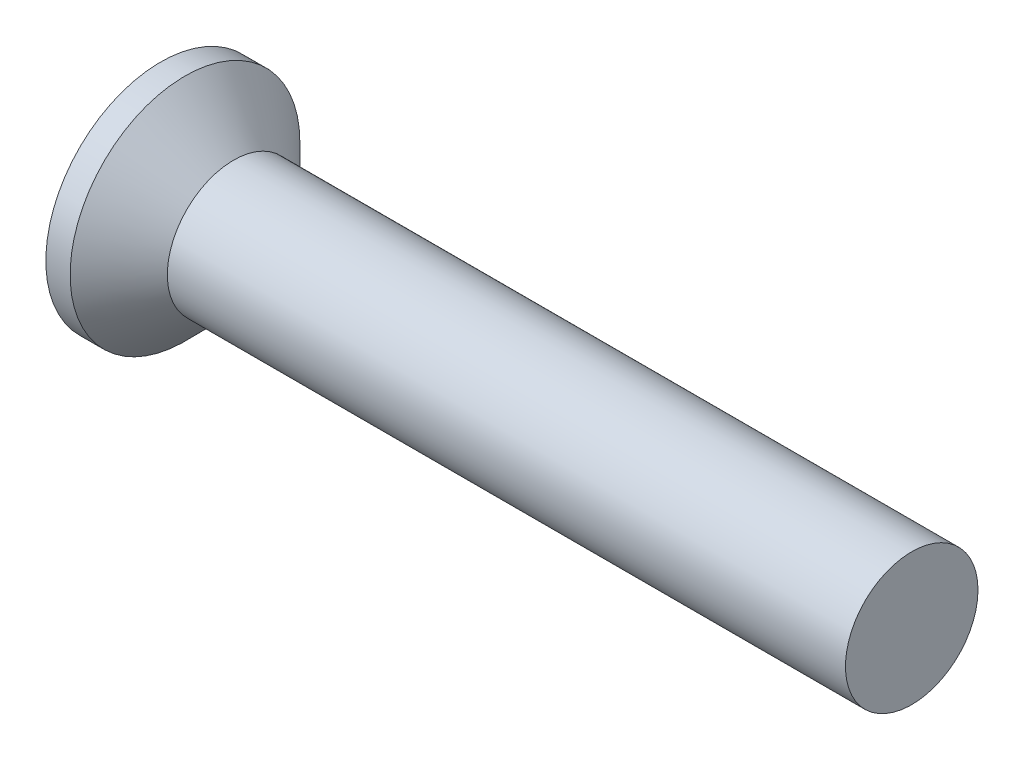
ISO-10303-21;
HEADER;
FILE_DESCRIPTION(('STEP AP214'),'2;1');
FILE_NAME('part.step','',(''),(''),'','','');
FILE_SCHEMA(('AUTOMOTIVE_DESIGN { 1 0 10303 214 1 1 1 1 }'));
ENDSEC;
DATA;
#1=APPLICATION_CONTEXT('core data for automotive mechanical design processes');
#2=APPLICATION_PROTOCOL_DEFINITION('international standard','automotive_design',2000,#1);
#3=PRODUCT_CONTEXT('',#1,'mechanical');
#4=PRODUCT('Part','Part','',(#3));
#5=PRODUCT_RELATED_PRODUCT_CATEGORY('part','',(#4));
#6=PRODUCT_DEFINITION_FORMATION('','',#4);
#7=PRODUCT_DEFINITION_CONTEXT('part definition',#1,'design');
#8=PRODUCT_DEFINITION('design','',#6,#7);
#9=PRODUCT_DEFINITION_SHAPE('','',#8);
#10=(LENGTH_UNIT() NAMED_UNIT(*) SI_UNIT(.MILLI.,.METRE.));
#11=(NAMED_UNIT(*) PLANE_ANGLE_UNIT() SI_UNIT($,.RADIAN.));
#12=(NAMED_UNIT(*) SI_UNIT($,.STERADIAN.) SOLID_ANGLE_UNIT());
#13=UNCERTAINTY_MEASURE_WITH_UNIT(LENGTH_MEASURE(1.E-05),#10,'distance_accuracy_value','');
#14=(GEOMETRIC_REPRESENTATION_CONTEXT(3) GLOBAL_UNCERTAINTY_ASSIGNED_CONTEXT((#13)) GLOBAL_UNIT_ASSIGNED_CONTEXT((#10,
#11,#12)) REPRESENTATION_CONTEXT('',''));
#15=CARTESIAN_POINT('',(0.,0.,0.));
#16=DIRECTION('',(0.,0.,1.));
#17=DIRECTION('',(1.,0.,0.));
#18=AXIS2_PLACEMENT_3D('',#15,#16,#17);
#19=CARTESIAN_POINT('',(0.,2.6,0.));
#20=DIRECTION('',(-1.,0.,0.));
#21=DIRECTION('',(0.,0.,1.));
#22=AXIS2_PLACEMENT_3D('',#19,#20,#21);
#23=PLANE('',#22);
#24=CARTESIAN_POINT('',(0.,0.,0.));
#25=DIRECTION('',(1.,0.,0.));
#26=DIRECTION('',(0.,0.,-1.));
#27=AXIS2_PLACEMENT_3D('',#24,#25,#26);
#28=CIRCLE('',#27,2.6);
#29=CARTESIAN_POINT('',(0.,0.,-2.6));
#30=VERTEX_POINT('',#29);
#31=EDGE_CURVE('E190',#30,#30,#28,.T.);
#32=ORIENTED_EDGE('',*,*,#31,.F.);
#33=EDGE_LOOP('',(#32));
#34=FACE_BOUND('',#33,.T.);
#35=DIRECTION('',(0.,1.,0.));
#36=VECTOR('',#35,1.);
#37=CARTESIAN_POINT('',(0.,-0.32,-0.32));
#38=LINE('',#37,#36);
#39=CARTESIAN_POINT('',(0.,-1.6,-0.32));
#40=VERTEX_POINT('',#39);
#41=CARTESIAN_POINT('',(0.,-0.62,-0.32));
#42=VERTEX_POINT('',#41);
#43=EDGE_CURVE('E316',#40,#42,#38,.T.);
#44=ORIENTED_EDGE('',*,*,#43,.T.);
#45=CARTESIAN_POINT('',(0.,-0.62,-0.62));
#46=DIRECTION('',(-1.,0.,0.));
#47=DIRECTION('',(0.,0.,1.));
#48=AXIS2_PLACEMENT_3D('',#45,#46,#47);
#49=CIRCLE('',#48,0.3);
#50=CARTESIAN_POINT('',(0.,-0.32,-0.62));
#51=VERTEX_POINT('',#50);
#52=EDGE_CURVE('E195',#42,#51,#49,.T.);
#53=ORIENTED_EDGE('',*,*,#52,.T.);
#54=DIRECTION('',(0.,0.,-1.));
#55=VECTOR('',#54,1.);
#56=CARTESIAN_POINT('',(0.,-0.32,-0.32));
#57=LINE('',#56,#55);
#58=CARTESIAN_POINT('',(0.,-0.32,-1.6));
#59=VERTEX_POINT('',#58);
#60=EDGE_CURVE('E318',#51,#59,#57,.T.);
#61=ORIENTED_EDGE('',*,*,#60,.T.);
#62=DIRECTION('',(0.,1.,0.));
#63=VECTOR('',#62,1.);
#64=CARTESIAN_POINT('',(0.,0.32,-1.6));
#65=LINE('',#64,#63);
#66=CARTESIAN_POINT('',(0.,0.32,-1.6));
#67=VERTEX_POINT('',#66);
#68=EDGE_CURVE('E320',#59,#67,#65,.T.);
#69=ORIENTED_EDGE('',*,*,#68,.T.);
#70=DIRECTION('',(0.,0.,1.));
#71=VECTOR('',#70,1.);
#72=CARTESIAN_POINT('',(0.,0.32,-0.32));
#73=LINE('',#72,#71);
#74=CARTESIAN_POINT('',(0.,0.32,-0.62));
#75=VERTEX_POINT('',#74);
#76=EDGE_CURVE('E323',#67,#75,#73,.T.);
#77=ORIENTED_EDGE('',*,*,#76,.T.);
#78=CARTESIAN_POINT('',(0.,0.62,-0.62));
#79=DIRECTION('',(-1.,0.,0.));
#80=DIRECTION('',(0.,0.,1.));
#81=AXIS2_PLACEMENT_3D('',#78,#79,#80);
#82=CIRCLE('',#81,0.3);
#83=CARTESIAN_POINT('',(0.,0.62,-0.32));
#84=VERTEX_POINT('',#83);
#85=EDGE_CURVE('E193',#75,#84,#82,.T.);
#86=ORIENTED_EDGE('',*,*,#85,.T.);
#87=DIRECTION('',(0.,1.,0.));
#88=VECTOR('',#87,1.);
#89=CARTESIAN_POINT('',(0.,0.32,-0.32));
#90=LINE('',#89,#88);
#91=CARTESIAN_POINT('',(0.,1.6,-0.32));
#92=VERTEX_POINT('',#91);
#93=EDGE_CURVE('E326',#84,#92,#90,.T.);
#94=ORIENTED_EDGE('',*,*,#93,.T.);
#95=DIRECTION('',(0.,0.,1.));
#96=VECTOR('',#95,1.);
#97=CARTESIAN_POINT('',(0.,1.6,-0.32));
#98=LINE('',#97,#96);
#99=CARTESIAN_POINT('',(0.,1.6,0.32));
#100=VERTEX_POINT('',#99);
#101=EDGE_CURVE('E328',#92,#100,#98,.T.);
#102=ORIENTED_EDGE('',*,*,#101,.T.);
#103=DIRECTION('',(0.,-1.,0.));
#104=VECTOR('',#103,1.);
#105=CARTESIAN_POINT('',(0.,0.32,0.32));
#106=LINE('',#105,#104);
#107=CARTESIAN_POINT('',(0.,0.62,0.32));
#108=VERTEX_POINT('',#107);
#109=EDGE_CURVE('E331',#100,#108,#106,.T.);
#110=ORIENTED_EDGE('',*,*,#109,.T.);
#111=CARTESIAN_POINT('',(0.,0.62,0.62));
#112=DIRECTION('',(-1.,0.,0.));
#113=DIRECTION('',(0.,0.,1.));
#114=AXIS2_PLACEMENT_3D('',#111,#112,#113);
#115=CIRCLE('',#114,0.3);
#116=CARTESIAN_POINT('',(0.,0.32,0.62));
#117=VERTEX_POINT('',#116);
#118=EDGE_CURVE('E158',#108,#117,#115,.T.);
#119=ORIENTED_EDGE('',*,*,#118,.T.);
#120=DIRECTION('',(0.,0.,1.));
#121=VECTOR('',#120,1.);
#122=CARTESIAN_POINT('',(0.,0.32,0.32));
#123=LINE('',#122,#121);
#124=CARTESIAN_POINT('',(0.,0.32,1.6));
#125=VERTEX_POINT('',#124);
#126=EDGE_CURVE('E152',#117,#125,#123,.T.);
#127=ORIENTED_EDGE('',*,*,#126,.T.);
#128=DIRECTION('',(0.,-1.,0.));
#129=VECTOR('',#128,1.);
#130=CARTESIAN_POINT('',(0.,0.32,1.6));
#131=LINE('',#130,#129);
#132=CARTESIAN_POINT('',(0.,-0.32,1.6));
#133=VERTEX_POINT('',#132);
#134=EDGE_CURVE('E156',#125,#133,#131,.T.);
#135=ORIENTED_EDGE('',*,*,#134,.T.);
#136=DIRECTION('',(0.,0.,-1.));
#137=VECTOR('',#136,1.);
#138=CARTESIAN_POINT('',(0.,-0.32,0.32));
#139=LINE('',#138,#137);
#140=CARTESIAN_POINT('',(0.,-0.32,0.62));
#141=VERTEX_POINT('',#140);
#142=EDGE_CURVE('E170',#133,#141,#139,.T.);
#143=ORIENTED_EDGE('',*,*,#142,.T.);
#144=CARTESIAN_POINT('',(0.,-0.62,0.62));
#145=DIRECTION('',(-1.,0.,0.));
#146=DIRECTION('',(0.,0.,1.));
#147=AXIS2_PLACEMENT_3D('',#144,#145,#146);
#148=CIRCLE('',#147,0.3);
#149=CARTESIAN_POINT('',(0.,-0.62,0.32));
#150=VERTEX_POINT('',#149);
#151=EDGE_CURVE('E189',#141,#150,#148,.T.);
#152=ORIENTED_EDGE('',*,*,#151,.T.);
#153=DIRECTION('',(0.,-1.,0.));
#154=VECTOR('',#153,1.);
#155=CARTESIAN_POINT('',(0.,-0.32,0.32));
#156=LINE('',#155,#154);
#157=CARTESIAN_POINT('',(0.,-1.6,0.319999999999999));
#158=VERTEX_POINT('',#157);
#159=EDGE_CURVE('E311',#150,#158,#156,.T.);
#160=ORIENTED_EDGE('',*,*,#159,.T.);
#161=DIRECTION('',(0.,0.,-1.));
#162=VECTOR('',#161,1.);
#163=CARTESIAN_POINT('',(0.,-1.6,-0.32));
#164=LINE('',#163,#162);
#165=EDGE_CURVE('E313',#158,#40,#164,.T.);
#166=ORIENTED_EDGE('',*,*,#165,.T.);
#167=EDGE_LOOP('',(#44,#53,#61,#69,#77,#86,#94,#102,#110,#119,#127,#135,#143,#152,#160,#166));
#168=FACE_BOUND('',#167,.T.);
#169=ADVANCED_FACE('F39',(#34,#168),#23,.T.);
#170=CARTESIAN_POINT('',(17.,1.5,0.));
#171=DIRECTION('',(1.,0.,0.));
#172=DIRECTION('',(0.,0.,-1.));
#173=AXIS2_PLACEMENT_3D('',#170,#171,#172);
#174=PLANE('',#173);
#175=CARTESIAN_POINT('',(17.,0.,0.));
#176=DIRECTION('',(1.,0.,0.));
#177=DIRECTION('',(0.,0.,-1.));
#178=AXIS2_PLACEMENT_3D('',#175,#176,#177);
#179=CIRCLE('',#178,1.5);
#180=CARTESIAN_POINT('',(17.,0.,-1.5));
#181=VERTEX_POINT('',#180);
#182=EDGE_CURVE('E176',#181,#181,#179,.T.);
#183=ORIENTED_EDGE('',*,*,#182,.T.);
#184=EDGE_LOOP('',(#183));
#185=FACE_BOUND('',#184,.T.);
#186=ADVANCED_FACE('F243',(#185),#174,.T.);
#187=CARTESIAN_POINT('',(4.51581291088132,0.,0.));
#188=DIRECTION('',(1.,0.,0.));
#189=DIRECTION('',(0.,0.,-1.));
#190=AXIS2_PLACEMENT_3D('',#187,#188,#189);
#191=CYLINDRICAL_SURFACE('',#190,2.6);
#192=ORIENTED_EDGE('',*,*,#31,.T.);
#193=EDGE_LOOP('',(#192));
#194=FACE_BOUND('',#193,.T.);
#195=CARTESIAN_POINT('',(0.550000000000004,0.,0.));
#196=DIRECTION('',(1.,0.,0.));
#197=DIRECTION('',(0.,0.,-1.));
#198=AXIS2_PLACEMENT_3D('',#195,#196,#197);
#199=CIRCLE('',#198,2.6);
#200=CARTESIAN_POINT('',(0.550000000000004,0.,-2.6));
#201=VERTEX_POINT('',#200);
#202=EDGE_CURVE('E335',#201,#201,#199,.T.);
#203=ORIENTED_EDGE('',*,*,#202,.F.);
#204=EDGE_LOOP('',(#203));
#205=FACE_BOUND('',#204,.T.);
#206=ADVANCED_FACE('F249',(#194,#205),#191,.T.);
#207=CARTESIAN_POINT('',(1.65,0.,0.));
#208=DIRECTION('',(-1.,0.,0.));
#209=DIRECTION('',(0.,0.,1.));
#210=AXIS2_PLACEMENT_3D('',#207,#208,#209);
#211=CONICAL_SURFACE('',#210,1.5,0.785398163397449);
#212=ORIENTED_EDGE('',*,*,#202,.T.);
#213=EDGE_LOOP('',(#212));
#214=FACE_BOUND('',#213,.T.);
#215=CARTESIAN_POINT('',(1.65,0.,0.));
#216=DIRECTION('',(1.,0.,0.));
#217=DIRECTION('',(0.,0.,-1.));
#218=AXIS2_PLACEMENT_3D('',#215,#216,#217);
#219=CIRCLE('',#218,1.5);
#220=CARTESIAN_POINT('',(1.65,0.,-1.5));
#221=VERTEX_POINT('',#220);
#222=EDGE_CURVE('E179',#221,#221,#219,.T.);
#223=ORIENTED_EDGE('',*,*,#222,.F.);
#224=EDGE_LOOP('',(#223));
#225=FACE_BOUND('',#224,.T.);
#226=ADVANCED_FACE('F371',(#214,#225),#211,.T.);
#227=CARTESIAN_POINT('',(4.51581291088132,0.,0.));
#228=DIRECTION('',(1.,0.,0.));
#229=DIRECTION('',(0.,0.,-1.));
#230=AXIS2_PLACEMENT_3D('',#227,#228,#229);
#231=CYLINDRICAL_SURFACE('',#230,1.5);
#232=ORIENTED_EDGE('',*,*,#222,.T.);
#233=EDGE_LOOP('',(#232));
#234=FACE_BOUND('',#233,.T.);
#235=ORIENTED_EDGE('',*,*,#182,.F.);
#236=EDGE_LOOP('',(#235));
#237=FACE_BOUND('',#236,.T.);
#238=ADVANCED_FACE('F369',(#234,#237),#231,.T.);
#239=CARTESIAN_POINT('',(0.825,0.32,0.32));
#240=DIRECTION('',(0.,-1.,0.));
#241=DIRECTION('',(0.,0.,-1.));
#242=AXIS2_PLACEMENT_3D('',#239,#240,#241);
#243=PLANE('',#242);
#244=ORIENTED_EDGE('',*,*,#126,.F.);
#245=DIRECTION('',(-1.,0.,0.));
#246=VECTOR('',#245,1.);
#247=CARTESIAN_POINT('',(0.825,0.32,0.62));
#248=LINE('',#247,#246);
#249=CARTESIAN_POINT('',(0.825,0.32,0.62));
#250=VERTEX_POINT('',#249);
#251=EDGE_CURVE('E207',#117,#250,#248,.F.);
#252=ORIENTED_EDGE('',*,*,#251,.T.);
#253=DIRECTION('',(0.,0.,1.));
#254=VECTOR('',#253,1.);
#255=CARTESIAN_POINT('',(0.825,0.32,0.32));
#256=LINE('',#255,#254);
#257=CARTESIAN_POINT('',(0.825,0.32,1.12368602791856));
#258=VERTEX_POINT('',#257);
#259=EDGE_CURVE('E174',#250,#258,#256,.T.);
#260=ORIENTED_EDGE('',*,*,#259,.T.);
#261=DIRECTION('',(-0.866025403784438,0.,0.500000000000001));
#262=VECTOR('',#261,1.);
#263=CARTESIAN_POINT('',(0.,0.32,1.6));
#264=LINE('',#263,#262);
#265=EDGE_CURVE('E166',#258,#125,#264,.T.);
#266=ORIENTED_EDGE('',*,*,#265,.T.);
#267=EDGE_LOOP('',(#244,#252,#260,#266));
#268=FACE_BOUND('',#267,.T.);
#269=ADVANCED_FACE('F172',(#268),#243,.T.);
#270=CARTESIAN_POINT('',(0.,0.32,1.6));
#271=DIRECTION('',(-0.500000000000001,0.,-0.866025403784438));
#272=DIRECTION('',(-0.866025403784438,0.,0.500000000000001));
#273=AXIS2_PLACEMENT_3D('',#270,#271,#272);
#274=PLANE('',#273);
#275=ORIENTED_EDGE('',*,*,#134,.F.);
#276=ORIENTED_EDGE('',*,*,#265,.F.);
#277=DIRECTION('',(0.,-1.,0.));
#278=VECTOR('',#277,1.);
#279=CARTESIAN_POINT('',(0.825,0.32,1.12368602791856));
#280=LINE('',#279,#278);
#281=CARTESIAN_POINT('',(0.825,-0.32,1.12368602791856));
#282=VERTEX_POINT('',#281);
#283=EDGE_CURVE('E185',#258,#282,#280,.T.);
#284=ORIENTED_EDGE('',*,*,#283,.T.);
#285=DIRECTION('',(-0.866025403784438,0.,0.500000000000001));
#286=VECTOR('',#285,1.);
#287=CARTESIAN_POINT('',(1.17300625842204,-0.32,0.922764520938917));
#288=LINE('',#287,#286);
#289=EDGE_CURVE('E168',#282,#133,#288,.T.);
#290=ORIENTED_EDGE('',*,*,#289,.T.);
#291=EDGE_LOOP('',(#275,#276,#284,#290));
#292=FACE_BOUND('',#291,.T.);
#293=ADVANCED_FACE('F165',(#292),#274,.T.);
#294=CARTESIAN_POINT('',(0.825,-0.32,0.32));
#295=DIRECTION('',(0.,1.,0.));
#296=DIRECTION('',(0.,0.,1.));
#297=AXIS2_PLACEMENT_3D('',#294,#295,#296);
#298=PLANE('',#297);
#299=DIRECTION('',(0.,0.,-1.));
#300=VECTOR('',#299,1.);
#301=CARTESIAN_POINT('',(0.825,-0.32,0.32));
#302=LINE('',#301,#300);
#303=CARTESIAN_POINT('',(0.825,-0.32,0.62));
#304=VERTEX_POINT('',#303);
#305=EDGE_CURVE('E357',#282,#304,#302,.T.);
#306=ORIENTED_EDGE('',*,*,#305,.T.);
#307=DIRECTION('',(-1.,0.,0.));
#308=VECTOR('',#307,1.);
#309=CARTESIAN_POINT('',(0.825,-0.32,0.62));
#310=LINE('',#309,#308);
#311=EDGE_CURVE('E209',#304,#141,#310,.T.);
#312=ORIENTED_EDGE('',*,*,#311,.T.);
#313=ORIENTED_EDGE('',*,*,#142,.F.);
#314=ORIENTED_EDGE('',*,*,#289,.F.);
#315=EDGE_LOOP('',(#306,#312,#313,#314));
#316=FACE_BOUND('',#315,.T.);
#317=ADVANCED_FACE('F263',(#316),#298,.T.);
#318=CARTESIAN_POINT('',(0.825,-0.32,0.32));
#319=DIRECTION('',(0.,0.,-1.));
#320=DIRECTION('',(0.,1.,0.));
#321=AXIS2_PLACEMENT_3D('',#318,#319,#320);
#322=PLANE('',#321);
#323=ORIENTED_EDGE('',*,*,#159,.F.);
#324=DIRECTION('',(-1.,0.,0.));
#325=VECTOR('',#324,1.);
#326=CARTESIAN_POINT('',(0.825,-0.62,0.32));
#327=LINE('',#326,#325);
#328=CARTESIAN_POINT('',(0.825,-0.62,0.32));
#329=VERTEX_POINT('',#328);
#330=EDGE_CURVE('E54',#150,#329,#327,.F.);
#331=ORIENTED_EDGE('',*,*,#330,.T.);
#332=DIRECTION('',(0.,-1.,0.));
#333=VECTOR('',#332,1.);
#334=CARTESIAN_POINT('',(0.825,-0.32,0.32));
#335=LINE('',#334,#333);
#336=CARTESIAN_POINT('',(0.825,-1.12368602791856,0.32));
#337=VERTEX_POINT('',#336);
#338=EDGE_CURVE('E300',#329,#337,#335,.T.);
#339=ORIENTED_EDGE('',*,*,#338,.T.);
#340=DIRECTION('',(-0.866025403784438,-0.500000000000001,0.));
#341=VECTOR('',#340,1.);
#342=CARTESIAN_POINT('',(0.,-1.6,0.319999999999999));
#343=LINE('',#342,#341);
#344=EDGE_CURVE('E181',#337,#158,#343,.T.);
#345=ORIENTED_EDGE('',*,*,#344,.T.);
#346=EDGE_LOOP('',(#323,#331,#339,#345));
#347=FACE_BOUND('',#346,.T.);
#348=ADVANCED_FACE('F268',(#347),#322,.T.);
#349=CARTESIAN_POINT('',(0.,-1.6,-0.32));
#350=DIRECTION('',(-0.500000000000001,0.866025403784438,0.));
#351=DIRECTION('',(-0.866025403784438,-0.500000000000001,0.));
#352=AXIS2_PLACEMENT_3D('',#349,#350,#351);
#353=PLANE('',#352);
#354=ORIENTED_EDGE('',*,*,#165,.F.);
#355=ORIENTED_EDGE('',*,*,#344,.F.);
#356=DIRECTION('',(0.,0.,-1.));
#357=VECTOR('',#356,1.);
#358=CARTESIAN_POINT('',(0.825,-1.12368602791856,-0.32));
#359=LINE('',#358,#357);
#360=CARTESIAN_POINT('',(0.825,-1.12368602791856,-0.32));
#361=VERTEX_POINT('',#360);
#362=EDGE_CURVE('E296',#337,#361,#359,.T.);
#363=ORIENTED_EDGE('',*,*,#362,.T.);
#364=DIRECTION('',(-0.866025403784438,-0.500000000000001,0.));
#365=VECTOR('',#364,1.);
#366=CARTESIAN_POINT('',(1.17300625842204,-0.922764520938918,-0.32));
#367=LINE('',#366,#365);
#368=EDGE_CURVE('E295',#361,#40,#367,.T.);
#369=ORIENTED_EDGE('',*,*,#368,.T.);
#370=EDGE_LOOP('',(#354,#355,#363,#369));
#371=FACE_BOUND('',#370,.T.);
#372=ADVANCED_FACE('F264',(#371),#353,.T.);
#373=CARTESIAN_POINT('',(0.825,-0.32,-0.32));
#374=DIRECTION('',(0.,0.,1.));
#375=DIRECTION('',(1.,0.,0.));
#376=AXIS2_PLACEMENT_3D('',#373,#374,#375);
#377=PLANE('',#376);
#378=DIRECTION('',(0.,1.,0.));
#379=VECTOR('',#378,1.);
#380=CARTESIAN_POINT('',(0.825,-0.32,-0.32));
#381=LINE('',#380,#379);
#382=CARTESIAN_POINT('',(0.825,-0.62,-0.32));
#383=VERTEX_POINT('',#382);
#384=EDGE_CURVE('E289',#361,#383,#381,.T.);
#385=ORIENTED_EDGE('',*,*,#384,.T.);
#386=DIRECTION('',(-1.,0.,0.));
#387=VECTOR('',#386,1.);
#388=CARTESIAN_POINT('',(0.825,-0.62,-0.32));
#389=LINE('',#388,#387);
#390=EDGE_CURVE('E186',#383,#42,#389,.T.);
#391=ORIENTED_EDGE('',*,*,#390,.T.);
#392=ORIENTED_EDGE('',*,*,#43,.F.);
#393=ORIENTED_EDGE('',*,*,#368,.F.);
#394=EDGE_LOOP('',(#385,#391,#392,#393));
#395=FACE_BOUND('',#394,.T.);
#396=ADVANCED_FACE('F267',(#395),#377,.T.);
#397=CARTESIAN_POINT('',(0.825,-0.32,-0.32));
#398=DIRECTION('',(0.,1.,0.));
#399=DIRECTION('',(0.,0.,1.));
#400=AXIS2_PLACEMENT_3D('',#397,#398,#399);
#401=PLANE('',#400);
#402=ORIENTED_EDGE('',*,*,#60,.F.);
#403=DIRECTION('',(-1.,0.,0.));
#404=VECTOR('',#403,1.);
#405=CARTESIAN_POINT('',(0.825,-0.32,-0.62));
#406=LINE('',#405,#404);
#407=CARTESIAN_POINT('',(0.825,-0.32,-0.62));
#408=VERTEX_POINT('',#407);
#409=EDGE_CURVE('E197',#51,#408,#406,.F.);
#410=ORIENTED_EDGE('',*,*,#409,.T.);
#411=DIRECTION('',(0.,0.,-1.));
#412=VECTOR('',#411,1.);
#413=CARTESIAN_POINT('',(0.825,-0.32,-0.32));
#414=LINE('',#413,#412);
#415=CARTESIAN_POINT('',(0.825,-0.32,-1.12368602791856));
#416=VERTEX_POINT('',#415);
#417=EDGE_CURVE('E291',#408,#416,#414,.T.);
#418=ORIENTED_EDGE('',*,*,#417,.T.);
#419=DIRECTION('',(-0.866025403784438,0.,-0.500000000000001));
#420=VECTOR('',#419,1.);
#421=CARTESIAN_POINT('',(0.,-0.32,-1.6));
#422=LINE('',#421,#420);
#423=EDGE_CURVE('E347',#416,#59,#422,.T.);
#424=ORIENTED_EDGE('',*,*,#423,.T.);
#425=EDGE_LOOP('',(#402,#410,#418,#424));
#426=FACE_BOUND('',#425,.T.);
#427=ADVANCED_FACE('F274',(#426),#401,.T.);
#428=CARTESIAN_POINT('',(0.,0.32,-1.6));
#429=DIRECTION('',(-0.500000000000001,0.,0.866025403784438));
#430=DIRECTION('',(0.866025403784438,0.,0.500000000000001));
#431=AXIS2_PLACEMENT_3D('',#428,#429,#430);
#432=PLANE('',#431);
#433=ORIENTED_EDGE('',*,*,#68,.F.);
#434=ORIENTED_EDGE('',*,*,#423,.F.);
#435=DIRECTION('',(0.,1.,0.));
#436=VECTOR('',#435,1.);
#437=CARTESIAN_POINT('',(0.825,0.32,-1.12368602791856));
#438=LINE('',#437,#436);
#439=CARTESIAN_POINT('',(0.825,0.32,-1.12368602791856));
#440=VERTEX_POINT('',#439);
#441=EDGE_CURVE('E298',#416,#440,#438,.T.);
#442=ORIENTED_EDGE('',*,*,#441,.T.);
#443=DIRECTION('',(-0.866025403784438,0.,-0.500000000000001));
#444=VECTOR('',#443,1.);
#445=CARTESIAN_POINT('',(1.17300625842204,0.32,-0.922764520938918));
#446=LINE('',#445,#444);
#447=EDGE_CURVE('E345',#440,#67,#446,.T.);
#448=ORIENTED_EDGE('',*,*,#447,.T.);
#449=EDGE_LOOP('',(#433,#434,#442,#448));
#450=FACE_BOUND('',#449,.T.);
#451=ADVANCED_FACE('F270',(#450),#432,.T.);
#452=CARTESIAN_POINT('',(0.825,0.32,-0.32));
#453=DIRECTION('',(0.,-1.,0.));
#454=DIRECTION('',(0.,0.,-1.));
#455=AXIS2_PLACEMENT_3D('',#452,#453,#454);
#456=PLANE('',#455);
#457=DIRECTION('',(0.,0.,1.));
#458=VECTOR('',#457,1.);
#459=CARTESIAN_POINT('',(0.825,0.32,-0.32));
#460=LINE('',#459,#458);
#461=CARTESIAN_POINT('',(0.825,0.32,-0.62));
#462=VERTEX_POINT('',#461);
#463=EDGE_CURVE('E305',#440,#462,#460,.T.);
#464=ORIENTED_EDGE('',*,*,#463,.T.);
#465=DIRECTION('',(-1.,0.,0.));
#466=VECTOR('',#465,1.);
#467=CARTESIAN_POINT('',(0.825,0.32,-0.62));
#468=LINE('',#467,#466);
#469=EDGE_CURVE('E199',#462,#75,#468,.T.);
#470=ORIENTED_EDGE('',*,*,#469,.T.);
#471=ORIENTED_EDGE('',*,*,#76,.F.);
#472=ORIENTED_EDGE('',*,*,#447,.F.);
#473=EDGE_LOOP('',(#464,#470,#471,#472));
#474=FACE_BOUND('',#473,.T.);
#475=ADVANCED_FACE('F273',(#474),#456,.T.);
#476=CARTESIAN_POINT('',(0.825,0.32,-0.32));
#477=DIRECTION('',(0.,0.,1.));
#478=DIRECTION('',(1.,0.,0.));
#479=AXIS2_PLACEMENT_3D('',#476,#477,#478);
#480=PLANE('',#479);
#481=ORIENTED_EDGE('',*,*,#93,.F.);
#482=DIRECTION('',(-1.,0.,0.));
#483=VECTOR('',#482,1.);
#484=CARTESIAN_POINT('',(0.825,0.62,-0.32));
#485=LINE('',#484,#483);
#486=CARTESIAN_POINT('',(0.825,0.62,-0.32));
#487=VERTEX_POINT('',#486);
#488=EDGE_CURVE('E202',#84,#487,#485,.F.);
#489=ORIENTED_EDGE('',*,*,#488,.T.);
#490=DIRECTION('',(0.,1.,0.));
#491=VECTOR('',#490,1.);
#492=CARTESIAN_POINT('',(0.825,0.32,-0.32));
#493=LINE('',#492,#491);
#494=CARTESIAN_POINT('',(0.825,1.12368602791856,-0.32));
#495=VERTEX_POINT('',#494);
#496=EDGE_CURVE('E308',#487,#495,#493,.T.);
#497=ORIENTED_EDGE('',*,*,#496,.T.);
#498=DIRECTION('',(-0.866025403784438,0.500000000000001,0.));
#499=VECTOR('',#498,1.);
#500=CARTESIAN_POINT('',(0.,1.6,-0.32));
#501=LINE('',#500,#499);
#502=EDGE_CURVE('E341',#495,#92,#501,.T.);
#503=ORIENTED_EDGE('',*,*,#502,.T.);
#504=EDGE_LOOP('',(#481,#489,#497,#503));
#505=FACE_BOUND('',#504,.T.);
#506=ADVANCED_FACE('F259',(#505),#480,.T.);
#507=CARTESIAN_POINT('',(0.,1.6,-0.32));
#508=DIRECTION('',(-0.500000000000001,-0.866025403784438,0.));
#509=DIRECTION('',(0.866025403784438,-0.500000000000001,0.));
#510=AXIS2_PLACEMENT_3D('',#507,#508,#509);
#511=PLANE('',#510);
#512=ORIENTED_EDGE('',*,*,#101,.F.);
#513=ORIENTED_EDGE('',*,*,#502,.F.);
#514=DIRECTION('',(0.,0.,1.));
#515=VECTOR('',#514,1.);
#516=CARTESIAN_POINT('',(0.825,1.12368602791856,-0.32));
#517=LINE('',#516,#515);
#518=CARTESIAN_POINT('',(0.825,1.12368602791856,0.32));
#519=VERTEX_POINT('',#518);
#520=EDGE_CURVE('E229',#495,#519,#517,.T.);
#521=ORIENTED_EDGE('',*,*,#520,.T.);
#522=DIRECTION('',(-0.866025403784438,0.500000000000001,0.));
#523=VECTOR('',#522,1.);
#524=CARTESIAN_POINT('',(1.17300625842204,0.922764520938918,0.32));
#525=LINE('',#524,#523);
#526=EDGE_CURVE('E228',#519,#100,#525,.T.);
#527=ORIENTED_EDGE('',*,*,#526,.T.);
#528=EDGE_LOOP('',(#512,#513,#521,#527));
#529=FACE_BOUND('',#528,.T.);
#530=ADVANCED_FACE('F256',(#529),#511,.T.);
#531=CARTESIAN_POINT('',(0.825,0.32,0.32));
#532=DIRECTION('',(0.,0.,-1.));
#533=DIRECTION('',(0.,1.,0.));
#534=AXIS2_PLACEMENT_3D('',#531,#532,#533);
#535=PLANE('',#534);
#536=DIRECTION('',(0.,-1.,0.));
#537=VECTOR('',#536,1.);
#538=CARTESIAN_POINT('',(0.825,0.32,0.32));
#539=LINE('',#538,#537);
#540=CARTESIAN_POINT('',(0.825,0.62,0.32));
#541=VERTEX_POINT('',#540);
#542=EDGE_CURVE('E221',#519,#541,#539,.T.);
#543=ORIENTED_EDGE('',*,*,#542,.T.);
#544=DIRECTION('',(-1.,0.,0.));
#545=VECTOR('',#544,1.);
#546=CARTESIAN_POINT('',(0.825,0.62,0.32));
#547=LINE('',#546,#545);
#548=EDGE_CURVE('E204',#541,#108,#547,.T.);
#549=ORIENTED_EDGE('',*,*,#548,.T.);
#550=ORIENTED_EDGE('',*,*,#109,.F.);
#551=ORIENTED_EDGE('',*,*,#526,.F.);
#552=EDGE_LOOP('',(#543,#549,#550,#551));
#553=FACE_BOUND('',#552,.T.);
#554=ADVANCED_FACE('F226',(#553),#535,.T.);
#555=CARTESIAN_POINT('',(0.825,0.32,0.32));
#556=DIRECTION('',(1.,0.,0.));
#557=DIRECTION('',(0.,0.,-1.));
#558=AXIS2_PLACEMENT_3D('',#555,#556,#557);
#559=PLANE('',#558);
#560=ORIENTED_EDGE('',*,*,#259,.F.);
#561=CARTESIAN_POINT('',(0.825,0.62,0.62));
#562=DIRECTION('',(1.,0.,0.));
#563=DIRECTION('',(0.,0.,-1.));
#564=AXIS2_PLACEMENT_3D('',#561,#562,#563);
#565=CIRCLE('',#564,0.3);
#566=EDGE_CURVE('E47',#250,#541,#565,.T.);
#567=ORIENTED_EDGE('',*,*,#566,.T.);
#568=ORIENTED_EDGE('',*,*,#542,.F.);
#569=ORIENTED_EDGE('',*,*,#520,.F.);
#570=ORIENTED_EDGE('',*,*,#496,.F.);
#571=CARTESIAN_POINT('',(0.825,0.62,-0.62));
#572=DIRECTION('',(1.,0.,0.));
#573=DIRECTION('',(0.,0.,-1.));
#574=AXIS2_PLACEMENT_3D('',#571,#572,#573);
#575=CIRCLE('',#574,0.3);
#576=EDGE_CURVE('E215',#487,#462,#575,.T.);
#577=ORIENTED_EDGE('',*,*,#576,.T.);
#578=ORIENTED_EDGE('',*,*,#463,.F.);
#579=ORIENTED_EDGE('',*,*,#441,.F.);
#580=ORIENTED_EDGE('',*,*,#417,.F.);
#581=CARTESIAN_POINT('',(0.825,-0.62,-0.62));
#582=DIRECTION('',(1.,0.,0.));
#583=DIRECTION('',(0.,0.,-1.));
#584=AXIS2_PLACEMENT_3D('',#581,#582,#583);
#585=CIRCLE('',#584,0.3);
#586=EDGE_CURVE('E213',#408,#383,#585,.T.);
#587=ORIENTED_EDGE('',*,*,#586,.T.);
#588=ORIENTED_EDGE('',*,*,#384,.F.);
#589=ORIENTED_EDGE('',*,*,#362,.F.);
#590=ORIENTED_EDGE('',*,*,#338,.F.);
#591=CARTESIAN_POINT('',(0.825,-0.62,0.62));
#592=DIRECTION('',(1.,0.,0.));
#593=DIRECTION('',(0.,0.,-1.));
#594=AXIS2_PLACEMENT_3D('',#591,#592,#593);
#595=CIRCLE('',#594,0.3);
#596=EDGE_CURVE('E11',#329,#304,#595,.T.);
#597=ORIENTED_EDGE('',*,*,#596,.T.);
#598=ORIENTED_EDGE('',*,*,#305,.F.);
#599=ORIENTED_EDGE('',*,*,#283,.F.);
#600=EDGE_LOOP('',(#560,#567,#568,#569,#570,#577,#578,#579,#580,#587,#588,#589,#590,#597,#598,#599));
#601=FACE_BOUND('',#600,.T.);
#602=ADVANCED_FACE('F219',(#601),#559,.F.);
#603=CARTESIAN_POINT('',(0.825,-0.62,-0.62));
#604=DIRECTION('',(-1.,0.,0.));
#605=DIRECTION('',(0.,0.,1.));
#606=AXIS2_PLACEMENT_3D('',#603,#604,#605);
#607=CYLINDRICAL_SURFACE('',#606,0.3);
#608=ORIENTED_EDGE('',*,*,#586,.F.);
#609=ORIENTED_EDGE('',*,*,#409,.F.);
#610=ORIENTED_EDGE('',*,*,#52,.F.);
#611=ORIENTED_EDGE('',*,*,#390,.F.);
#612=EDGE_LOOP('',(#608,#609,#610,#611));
#613=FACE_BOUND('',#612,.T.);
#614=ADVANCED_FACE('F239',(#613),#607,.T.);
#615=CARTESIAN_POINT('',(0.825,0.62,-0.62));
#616=DIRECTION('',(-1.,0.,0.));
#617=DIRECTION('',(0.,0.,1.));
#618=AXIS2_PLACEMENT_3D('',#615,#616,#617);
#619=CYLINDRICAL_SURFACE('',#618,0.3);
#620=ORIENTED_EDGE('',*,*,#576,.F.);
#621=ORIENTED_EDGE('',*,*,#488,.F.);
#622=ORIENTED_EDGE('',*,*,#85,.F.);
#623=ORIENTED_EDGE('',*,*,#469,.F.);
#624=EDGE_LOOP('',(#620,#621,#622,#623));
#625=FACE_BOUND('',#624,.T.);
#626=ADVANCED_FACE('F233',(#625),#619,.T.);
#627=CARTESIAN_POINT('',(0.825,0.62,0.62));
#628=DIRECTION('',(-1.,0.,0.));
#629=DIRECTION('',(0.,0.,1.));
#630=AXIS2_PLACEMENT_3D('',#627,#628,#629);
#631=CYLINDRICAL_SURFACE('',#630,0.3);
#632=ORIENTED_EDGE('',*,*,#566,.F.);
#633=ORIENTED_EDGE('',*,*,#251,.F.);
#634=ORIENTED_EDGE('',*,*,#118,.F.);
#635=ORIENTED_EDGE('',*,*,#548,.F.);
#636=EDGE_LOOP('',(#632,#633,#634,#635));
#637=FACE_BOUND('',#636,.T.);
#638=ADVANCED_FACE('F231',(#637),#631,.T.);
#639=CARTESIAN_POINT('',(0.825,-0.62,0.62));
#640=DIRECTION('',(-1.,0.,0.));
#641=DIRECTION('',(0.,0.,1.));
#642=AXIS2_PLACEMENT_3D('',#639,#640,#641);
#643=CYLINDRICAL_SURFACE('',#642,0.3);
#644=ORIENTED_EDGE('',*,*,#596,.F.);
#645=ORIENTED_EDGE('',*,*,#330,.F.);
#646=ORIENTED_EDGE('',*,*,#151,.F.);
#647=ORIENTED_EDGE('',*,*,#311,.F.);
#648=EDGE_LOOP('',(#644,#645,#646,#647));
#649=FACE_BOUND('',#648,.T.);
#650=ADVANCED_FACE('F41',(#649),#643,.T.);
#651=CLOSED_SHELL('',(#169,#186,#206,#226,#238,#269,#293,#317,#348,#372,#396,#427,#451,#475,
#506,#530,#554,#602,#614,#626,#638,#650));
#652=MANIFOLD_SOLID_BREP('B2',#651);
#653=ADVANCED_BREP_SHAPE_REPRESENTATION('',(#18,#652),#14);
#654=SHAPE_DEFINITION_REPRESENTATION(#9,#653);
ENDSEC;
END-ISO-10303-21;
